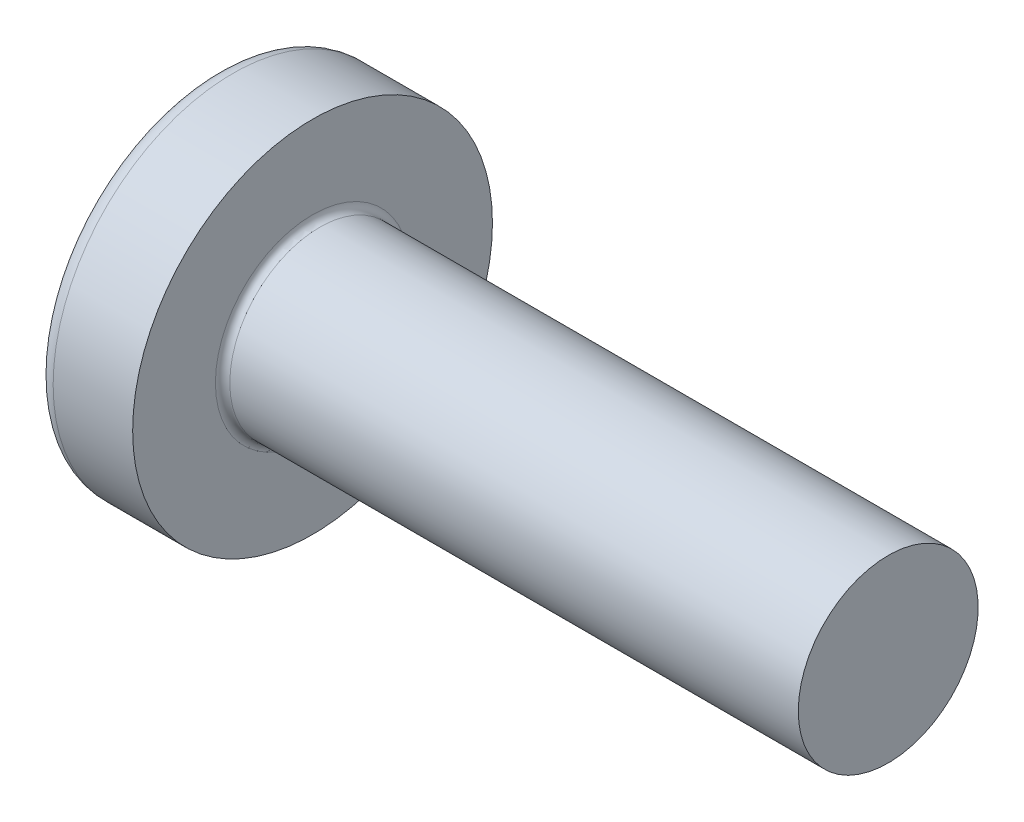
ISO-10303-21;
HEADER;
FILE_DESCRIPTION(('STEP AP214'),'2;1');
FILE_NAME('part.step','',(''),(''),'','','');
FILE_SCHEMA(('AUTOMOTIVE_DESIGN { 1 0 10303 214 1 1 1 1 }'));
ENDSEC;
DATA;
#1=APPLICATION_CONTEXT('core data for automotive mechanical design processes');
#2=APPLICATION_PROTOCOL_DEFINITION('international standard','automotive_design',2000,#1);
#3=PRODUCT_CONTEXT('',#1,'mechanical');
#4=PRODUCT('Part','Part','',(#3));
#5=PRODUCT_RELATED_PRODUCT_CATEGORY('part','',(#4));
#6=PRODUCT_DEFINITION_FORMATION('','',#4);
#7=PRODUCT_DEFINITION_CONTEXT('part definition',#1,'design');
#8=PRODUCT_DEFINITION('design','',#6,#7);
#9=PRODUCT_DEFINITION_SHAPE('','',#8);
#10=(LENGTH_UNIT() NAMED_UNIT(*) SI_UNIT(.MILLI.,.METRE.));
#11=(NAMED_UNIT(*) PLANE_ANGLE_UNIT() SI_UNIT($,.RADIAN.));
#12=(NAMED_UNIT(*) SI_UNIT($,.STERADIAN.) SOLID_ANGLE_UNIT());
#13=UNCERTAINTY_MEASURE_WITH_UNIT(LENGTH_MEASURE(1.E-05),#10,'distance_accuracy_value','');
#14=(GEOMETRIC_REPRESENTATION_CONTEXT(3) GLOBAL_UNCERTAINTY_ASSIGNED_CONTEXT((#13)) GLOBAL_UNIT_ASSIGNED_CONTEXT((#10,
#11,#12)) REPRESENTATION_CONTEXT('',''));
#15=CARTESIAN_POINT('',(0.,0.,0.));
#16=DIRECTION('',(0.,0.,1.));
#17=DIRECTION('',(1.,0.,0.));
#18=AXIS2_PLACEMENT_3D('',#15,#16,#17);
#19=CARTESIAN_POINT('',(4.,0.,0.));
#20=DIRECTION('',(-1.,0.,0.));
#21=DIRECTION('',(0.,1.,0.));
#22=AXIS2_PLACEMENT_3D('',#19,#20,#21);
#23=SPHERICAL_SURFACE('',#22,4.);
#24=CARTESIAN_POINT('',(0.803195914613468,0.,0.));
#25=DIRECTION('',(-1.,0.,0.));
#26=DIRECTION('',(0.,0.,1.));
#27=AXIS2_PLACEMENT_3D('',#24,#25,#26);
#28=CIRCLE('',#27,2.40425531914894);
#29=CARTESIAN_POINT('',(0.803195914613468,0.,2.40425531914894));
#30=VERTEX_POINT('',#29);
#31=EDGE_CURVE('E238',#30,#30,#28,.T.);
#32=ORIENTED_EDGE('',*,*,#31,.T.);
#33=EDGE_LOOP('',(#32));
#34=FACE_BOUND('',#33,.T.);
#35=CARTESIAN_POINT('',(0.0543400780062932,0.,0.));
#36=DIRECTION('',(1.,0.,0.));
#37=DIRECTION('',(0.,0.,-1.));
#38=AXIS2_PLACEMENT_3D('',#35,#36,#37);
#39=CIRCLE('',#38,0.657090389499513);
#40=CARTESIAN_POINT('',(0.0543400780062951,-0.369999999999997,-0.543017292517121));
#41=VERTEX_POINT('',#40);
#42=CARTESIAN_POINT('',(0.0543400780062936,-0.543017292517123,-0.37));
#43=VERTEX_POINT('',#42);
#44=EDGE_CURVE('E374',#41,#43,#39,.F.);
#45=ORIENTED_EDGE('',*,*,#44,.F.);
#46=CARTESIAN_POINT('',(4.,-0.370000000000001,0.));
#47=DIRECTION('',(0.,1.,0.));
#48=DIRECTION('',(0.,0.,1.));
#49=AXIS2_PLACEMENT_3D('',#46,#47,#48);
#50=CIRCLE('',#49,3.98285073785097);
#51=CARTESIAN_POINT('',(0.201999111211585,-0.369999999999995,-1.19928697514916));
#52=VERTEX_POINT('',#51);
#53=EDGE_CURVE('E300',#52,#41,#50,.T.);
#54=ORIENTED_EDGE('',*,*,#53,.F.);
#55=CARTESIAN_POINT('',(3.72274328891674,0.,0.556091024961349));
#56=DIRECTION('',(0.446197753347436,0.,-0.894934391398443));
#57=DIRECTION('',(-0.894934391398443,0.,-0.446197753347436));
#58=AXIS2_PLACEMENT_3D('',#55,#56,#57);
#59=CIRCLE('',#58,3.95144169742092);
#60=CARTESIAN_POINT('',(0.201999111211586,0.370000000000004,-1.19928697514915));
#61=VERTEX_POINT('',#60);
#62=EDGE_CURVE('E272',#52,#61,#59,.T.);
#63=ORIENTED_EDGE('',*,*,#62,.T.);
#64=CARTESIAN_POINT('',(4.,0.369999999999999,0.));
#65=DIRECTION('',(0.,-1.,0.));
#66=DIRECTION('',(0.,0.,-1.));
#67=AXIS2_PLACEMENT_3D('',#64,#65,#66);
#68=CIRCLE('',#67,3.98285073785097);
#69=CARTESIAN_POINT('',(0.0543400780062952,0.370000000000002,-0.543017292517117));
#70=VERTEX_POINT('',#69);
#71=EDGE_CURVE('E327',#70,#61,#68,.T.);
#72=ORIENTED_EDGE('',*,*,#71,.F.);
#73=CARTESIAN_POINT('',(0.0543400780062936,0.543017292517112,-0.37));
#74=VERTEX_POINT('',#73);
#75=EDGE_CURVE('E393',#74,#70,#39,.F.);
#76=ORIENTED_EDGE('',*,*,#75,.F.);
#77=CARTESIAN_POINT('',(4.,0.,-0.369999999999999));
#78=DIRECTION('',(0.,0.,1.));
#79=DIRECTION('',(1.,0.,0.));
#80=AXIS2_PLACEMENT_3D('',#77,#78,#79);
#81=CIRCLE('',#80,3.98285073785097);
#82=CARTESIAN_POINT('',(0.201999111211586,1.19928697514915,-0.37));
#83=VERTEX_POINT('',#82);
#84=EDGE_CURVE('E266',#83,#74,#81,.T.);
#85=ORIENTED_EDGE('',*,*,#84,.F.);
#86=CARTESIAN_POINT('',(3.72274328891675,-0.55609102496135,0.));
#87=DIRECTION('',(0.446197753347436,0.894934391398443,0.));
#88=DIRECTION('',(-0.894934391398443,0.446197753347436,0.));
#89=AXIS2_PLACEMENT_3D('',#86,#87,#88);
#90=CIRCLE('',#89,3.95144169742092);
#91=CARTESIAN_POINT('',(0.201999111211587,1.19928697514915,0.37));
#92=VERTEX_POINT('',#91);
#93=EDGE_CURVE('E269',#83,#92,#90,.T.);
#94=ORIENTED_EDGE('',*,*,#93,.T.);
#95=CARTESIAN_POINT('',(4.,0.,0.370000000000001));
#96=DIRECTION('',(0.,0.,-1.));
#97=DIRECTION('',(-1.,0.,0.));
#98=AXIS2_PLACEMENT_3D('',#95,#96,#97);
#99=CIRCLE('',#98,3.98285073785097);
#100=CARTESIAN_POINT('',(0.0543400780062932,0.543017292517108,0.369999999999999));
#101=VERTEX_POINT('',#100);
#102=EDGE_CURVE('E262',#101,#92,#99,.T.);
#103=ORIENTED_EDGE('',*,*,#102,.F.);
#104=CARTESIAN_POINT('',(0.0543400780062959,0.369999999999998,0.54301729251712));
#105=VERTEX_POINT('',#104);
#106=EDGE_CURVE('E427',#105,#101,#39,.F.);
#107=ORIENTED_EDGE('',*,*,#106,.F.);
#108=CARTESIAN_POINT('',(0.201999111211586,0.369999999999996,1.19928697514915));
#109=VERTEX_POINT('',#108);
#110=EDGE_CURVE('E282',#109,#105,#68,.T.);
#111=ORIENTED_EDGE('',*,*,#110,.F.);
#112=CARTESIAN_POINT('',(3.72274328891674,0.,-0.556091024961349));
#113=DIRECTION('',(0.446197753347436,0.,0.894934391398443));
#114=DIRECTION('',(0.894934391398443,0.,-0.446197753347436));
#115=AXIS2_PLACEMENT_3D('',#112,#113,#114);
#116=CIRCLE('',#115,3.95144169742092);
#117=CARTESIAN_POINT('',(0.201999111211585,-0.370000000000004,1.19928697514915));
#118=VERTEX_POINT('',#117);
#119=EDGE_CURVE('E49',#109,#118,#116,.T.);
#120=ORIENTED_EDGE('',*,*,#119,.T.);
#121=CARTESIAN_POINT('',(0.0543400780062944,-0.370000000000001,0.543017292517118));
#122=VERTEX_POINT('',#121);
#123=EDGE_CURVE('E279',#122,#118,#50,.T.);
#124=ORIENTED_EDGE('',*,*,#123,.F.);
#125=CARTESIAN_POINT('',(0.0543400780062932,-0.543017292517118,0.369999999999999));
#126=VERTEX_POINT('',#125);
#127=EDGE_CURVE('E392',#126,#122,#39,.F.);
#128=ORIENTED_EDGE('',*,*,#127,.F.);
#129=CARTESIAN_POINT('',(0.201999111211583,-1.19928697514916,0.369999999999999));
#130=VERTEX_POINT('',#129);
#131=EDGE_CURVE('E263',#130,#126,#99,.T.);
#132=ORIENTED_EDGE('',*,*,#131,.F.);
#133=CARTESIAN_POINT('',(3.72274328891674,0.556091024961348,0.));
#134=DIRECTION('',(0.446197753347436,-0.894934391398443,0.));
#135=DIRECTION('',(0.894934391398443,0.446197753347436,0.));
#136=AXIS2_PLACEMENT_3D('',#133,#134,#135);
#137=CIRCLE('',#136,3.95144169742092);
#138=CARTESIAN_POINT('',(0.201999111211583,-1.19928697514915,-0.37));
#139=VERTEX_POINT('',#138);
#140=EDGE_CURVE('E259',#130,#139,#137,.T.);
#141=ORIENTED_EDGE('',*,*,#140,.T.);
#142=EDGE_CURVE('E64',#43,#139,#81,.T.);
#143=ORIENTED_EDGE('',*,*,#142,.F.);
#144=EDGE_LOOP('',(#45,#54,#63,#72,#76,#85,#94,#103,#107,#111,#120,#124,#128,#132,#141,#143));
#145=FACE_BOUND('',#144,.T.);
#146=ADVANCED_FACE('F36',(#34,#145),#23,.T.);
#147=CARTESIAN_POINT('',(1.5,0.552127712987655,-0.37));
#148=DIRECTION('',(0.,0.,1.));
#149=DIRECTION('',(1.,0.,0.));
#150=AXIS2_PLACEMENT_3D('',#147,#148,#149);
#151=PLANE('',#150);
#152=ORIENTED_EDGE('',*,*,#84,.T.);
#153=CARTESIAN_POINT('',(-0.984107487670367,0.628943903400079,-0.37));
#154=CARTESIAN_POINT('',(-0.783603343010497,0.61266994729586,-0.37));
#155=CARTESIAN_POINT('',(-0.583110931105435,0.596248129681252,-0.37));
#156=CARTESIAN_POINT('',(-0.182155788453109,0.562989164841799,-0.37));
#157=CARTESIAN_POINT('',(0.0183069414727268,0.546152007726099,-0.37));
#158=CARTESIAN_POINT('',(0.419186928470242,0.511943523152269,-0.37));
#159=CARTESIAN_POINT('',(0.619604185545593,0.494572195737286,-0.37));
#160=CARTESIAN_POINT('',(1.02037173794803,0.459102589125813,-0.37));
#161=CARTESIAN_POINT('',(1.2207220342401,0.441004320904832,-0.37));
#162=CARTESIAN_POINT('',(1.53631168775438,0.411665443099097,-0.37));
#163=CARTESIAN_POINT('',(1.65158348734389,0.400774467003668,-0.37));
#164=CARTESIAN_POINT('',(1.88208360561995,0.378547148307843,-0.37));
#165=CARTESIAN_POINT('',(1.99731192453001,0.367210808029148,-0.37));
#166=CARTESIAN_POINT('',(2.22771614129417,0.343963614894539,-0.37));
#167=CARTESIAN_POINT('',(2.34289203669258,0.332052737461205,-0.37));
#168=CARTESIAN_POINT('',(2.57315819348689,0.307413208767175,-0.37));
#169=CARTESIAN_POINT('',(2.68824845325201,0.294684542317003,-0.37));
#170=CARTESIAN_POINT('',(2.80327961663977,0.281425340988347,-0.37));
#171=B_SPLINE_CURVE_WITH_KNOTS('',3,(#153,#154,#155,#156,#157,#158,#159,#160,#161,#162,#163,
#164,#165,#166,#167,#168,#169,#170),.UNSPECIFIED.,.F.,.F.,(4,2,2,2,2,2,2,2,4),(0.,
0.603490856265592,1.20699609790448,1.81050129079485,2.41399737525605,2.76135214324501,
3.1087051006998,3.45607293034176,3.80344721380205),.UNSPECIFIED.);
#172=CARTESIAN_POINT('',(1.5,0.415013252800437,-0.370000000000001));
#173=VERTEX_POINT('',#172);
#174=EDGE_CURVE('E414',#74,#173,#171,.T.);
#175=ORIENTED_EDGE('',*,*,#174,.T.);
#176=DIRECTION('',(0.,1.,0.));
#177=VECTOR('',#176,1.);
#178=CARTESIAN_POINT('',(1.5,-0.552127712987656,-0.37));
#179=LINE('',#178,#177);
#180=CARTESIAN_POINT('',(1.5,0.552127712987655,-0.37));
#181=VERTEX_POINT('',#180);
#182=EDGE_CURVE('E356',#173,#181,#179,.T.);
#183=ORIENTED_EDGE('',*,*,#182,.T.);
#184=DIRECTION('',(0.894934391398442,-0.446197753347436,0.));
#185=VECTOR('',#184,1.);
#186=CARTESIAN_POINT('',(0.,1.3,-0.37));
#187=LINE('',#186,#185);
#188=EDGE_CURVE('E239',#83,#181,#187,.T.);
#189=ORIENTED_EDGE('',*,*,#188,.F.);
#190=EDGE_LOOP('',(#152,#175,#183,#189));
#191=FACE_BOUND('',#190,.T.);
#192=ADVANCED_FACE('F194',(#191),#151,.T.);
#193=CARTESIAN_POINT('',(1.5,-0.552127712987656,-0.37));
#194=VERTEX_POINT('',#193);
#195=CARTESIAN_POINT('',(1.5,-0.415013252800437,-0.370000000000001));
#196=VERTEX_POINT('',#195);
#197=EDGE_CURVE('E247',#194,#196,#179,.T.);
#198=ORIENTED_EDGE('',*,*,#197,.T.);
#199=CARTESIAN_POINT('',(-0.984107487670368,-0.628943903400079,-0.37));
#200=CARTESIAN_POINT('',(-0.783603343010499,-0.61266994729586,-0.37));
#201=CARTESIAN_POINT('',(-0.583110931105436,-0.596248129681252,-0.37));
#202=CARTESIAN_POINT('',(-0.18215578845311,-0.562989164841799,-0.37));
#203=CARTESIAN_POINT('',(0.0183069414727261,-0.546152007726099,-0.37));
#204=CARTESIAN_POINT('',(0.419186928470242,-0.511943523152269,-0.37));
#205=CARTESIAN_POINT('',(0.619604185545593,-0.494572195737286,-0.37));
#206=CARTESIAN_POINT('',(1.02037173794803,-0.459102589125813,-0.37));
#207=CARTESIAN_POINT('',(1.22072203424009,-0.441004320904832,-0.37));
#208=CARTESIAN_POINT('',(1.53631168775438,-0.411665443099097,-0.37));
#209=CARTESIAN_POINT('',(1.65158348734389,-0.400774467003668,-0.37));
#210=CARTESIAN_POINT('',(1.88208360561995,-0.378547148307843,-0.37));
#211=CARTESIAN_POINT('',(1.99731192453001,-0.367210808029148,-0.37));
#212=CARTESIAN_POINT('',(2.22771614129417,-0.343963614894539,-0.37));
#213=CARTESIAN_POINT('',(2.34289203669258,-0.332052737461204,-0.37));
#214=CARTESIAN_POINT('',(2.57315819348689,-0.307413208767175,-0.37));
#215=CARTESIAN_POINT('',(2.68824845325202,-0.294684542317003,-0.37));
#216=CARTESIAN_POINT('',(2.80327961663977,-0.281425340988347,-0.37));
#217=B_SPLINE_CURVE_WITH_KNOTS('',3,(#199,#200,#201,#202,#203,#204,#205,#206,#207,#208,#209,
#210,#211,#212,#213,#214,#215,#216),.UNSPECIFIED.,.F.,.F.,(4,2,2,2,2,2,2,2,4),(0.,
0.603490856265592,1.20699609790448,1.81050129079485,2.41399737525605,2.76135214324501,
3.1087051006998,3.45607293034176,3.80344721380205),.UNSPECIFIED.);
#218=EDGE_CURVE('E391',#196,#43,#217,.F.);
#219=ORIENTED_EDGE('',*,*,#218,.T.);
#220=ORIENTED_EDGE('',*,*,#142,.T.);
#221=DIRECTION('',(0.894934391398442,0.446197753347436,0.));
#222=VECTOR('',#221,1.);
#223=CARTESIAN_POINT('',(0.,-1.3,-0.37));
#224=LINE('',#223,#222);
#225=EDGE_CURVE('E330',#139,#194,#224,.T.);
#226=ORIENTED_EDGE('',*,*,#225,.T.);
#227=EDGE_LOOP('',(#198,#219,#220,#226));
#228=FACE_BOUND('',#227,.T.);
#229=ADVANCED_FACE('F200',(#228),#151,.T.);
#230=CARTESIAN_POINT('',(1.5,-0.552127712987656,0.37));
#231=DIRECTION('',(0.,0.,-1.));
#232=DIRECTION('',(-1.,0.,0.));
#233=AXIS2_PLACEMENT_3D('',#230,#231,#232);
#234=PLANE('',#233);
#235=DIRECTION('',(0.,-1.,0.));
#236=VECTOR('',#235,1.);
#237=CARTESIAN_POINT('',(1.5,0.552127712987656,0.37));
#238=LINE('',#237,#236);
#239=CARTESIAN_POINT('',(1.5,0.552127712987656,0.37));
#240=VERTEX_POINT('',#239);
#241=CARTESIAN_POINT('',(1.5,0.415013252800437,0.370000000000001));
#242=VERTEX_POINT('',#241);
#243=EDGE_CURVE('E339',#240,#242,#238,.T.);
#244=ORIENTED_EDGE('',*,*,#243,.T.);
#245=CARTESIAN_POINT('',(-0.984107487668668,0.628943903399942,0.369999999999999));
#246=CARTESIAN_POINT('',(-0.783603343008973,0.612669947295736,0.369999999999999));
#247=CARTESIAN_POINT('',(-0.583110931104085,0.596248129681141,0.369999999999999));
#248=CARTESIAN_POINT('',(-0.182155788452108,0.562989164841716,0.369999999999999));
#249=CARTESIAN_POINT('',(0.018306941473554,0.54615200772603,0.369999999999999));
#250=CARTESIAN_POINT('',(0.419186928470488,0.511943523152248,0.369999999999999));
#251=CARTESIAN_POINT('',(0.619604185545431,0.4945721957373,0.369999999999999));
#252=CARTESIAN_POINT('',(1.02037173794706,0.459102589125901,0.37));
#253=CARTESIAN_POINT('',(1.22072203423871,0.441004320904958,0.37));
#254=CARTESIAN_POINT('',(1.53631168775259,0.411665443099266,0.37));
#255=CARTESIAN_POINT('',(1.65158348734209,0.400774467003839,0.37));
#256=CARTESIAN_POINT('',(1.88208360561816,0.378547148308018,0.37));
#257=CARTESIAN_POINT('',(1.99731192452822,0.367210808029325,0.37));
#258=CARTESIAN_POINT('',(2.22771614129237,0.343963614894723,0.37));
#259=CARTESIAN_POINT('',(2.34289203669079,0.332052737461391,0.37));
#260=CARTESIAN_POINT('',(2.5731581934851,0.30741320876737,0.370000000000001));
#261=CARTESIAN_POINT('',(2.68824845325022,0.294684542317203,0.370000000000001));
#262=CARTESIAN_POINT('',(2.80327961663798,0.281425340988553,0.370000000000001));
#263=B_SPLINE_CURVE_WITH_KNOTS('',3,(#245,#246,#247,#248,#249,#250,#251,#252,#253,#254,#255,
#256,#257,#258,#259,#260,#261,#262),.UNSPECIFIED.,.F.,.F.,(4,2,2,2,2,2,2,2,4),(0.,
0.603490856265067,1.20699609790343,1.81050129079257,2.41399737525255,2.7613521432415,
3.1087051006963,3.45607293033825,3.80344721379854),.UNSPECIFIED.);
#264=EDGE_CURVE('E428',#242,#101,#263,.F.);
#265=ORIENTED_EDGE('',*,*,#264,.T.);
#266=ORIENTED_EDGE('',*,*,#102,.T.);
#267=DIRECTION('',(0.894934391398443,-0.446197753347436,0.));
#268=VECTOR('',#267,1.);
#269=CARTESIAN_POINT('',(0.,1.3,0.37));
#270=LINE('',#269,#268);
#271=EDGE_CURVE('E244',#92,#240,#270,.T.);
#272=ORIENTED_EDGE('',*,*,#271,.T.);
#273=EDGE_LOOP('',(#244,#265,#266,#272));
#274=FACE_BOUND('',#273,.T.);
#275=ADVANCED_FACE('F410',(#274),#234,.T.);
#276=ORIENTED_EDGE('',*,*,#131,.T.);
#277=CARTESIAN_POINT('',(-0.984107487670366,-0.62894390340008,0.369999999999999));
#278=CARTESIAN_POINT('',(-0.783603343010497,-0.612669947295861,0.369999999999999));
#279=CARTESIAN_POINT('',(-0.583110931105434,-0.596248129681253,0.369999999999999));
#280=CARTESIAN_POINT('',(-0.182155788453108,-0.5629891648418,0.369999999999999));
#281=CARTESIAN_POINT('',(0.0183069414727277,-0.5461520077261,0.369999999999999));
#282=CARTESIAN_POINT('',(0.419186928470243,-0.511943523152269,0.369999999999999));
#283=CARTESIAN_POINT('',(0.619604185545594,-0.494572195737286,0.369999999999999));
#284=CARTESIAN_POINT('',(1.02037173794804,-0.459102589125813,0.37));
#285=CARTESIAN_POINT('',(1.2207220342401,-0.441004320904833,0.37));
#286=CARTESIAN_POINT('',(1.53631168775438,-0.411665443099097,0.37));
#287=CARTESIAN_POINT('',(1.65158348734389,-0.400774467003668,0.37));
#288=CARTESIAN_POINT('',(1.88208360561995,-0.378547148307843,0.37));
#289=CARTESIAN_POINT('',(1.99731192453001,-0.367210808029148,0.37));
#290=CARTESIAN_POINT('',(2.22771614129417,-0.343963614894539,0.37));
#291=CARTESIAN_POINT('',(2.34289203669258,-0.332052737461204,0.37));
#292=CARTESIAN_POINT('',(2.57315819348689,-0.307413208767174,0.37));
#293=CARTESIAN_POINT('',(2.68824845325201,-0.294684542317002,0.370000000000001));
#294=CARTESIAN_POINT('',(2.80327961663977,-0.281425340988346,0.370000000000001));
#295=B_SPLINE_CURVE_WITH_KNOTS('',3,(#277,#278,#279,#280,#281,#282,#283,#284,#285,#286,#287,
#288,#289,#290,#291,#292,#293,#294),.UNSPECIFIED.,.F.,.F.,(4,2,2,2,2,2,2,2,4),(0.,
0.603490856265592,1.20699609790448,1.81050129079485,2.41399737525605,2.76135214324501,
3.1087051006998,3.45607293034176,3.80344721380205),.UNSPECIFIED.);
#296=CARTESIAN_POINT('',(1.5,-0.415013252800437,0.370000000000001));
#297=VERTEX_POINT('',#296);
#298=EDGE_CURVE('E447',#126,#297,#295,.T.);
#299=ORIENTED_EDGE('',*,*,#298,.T.);
#300=CARTESIAN_POINT('',(1.5,-0.552127712987656,0.37));
#301=VERTEX_POINT('',#300);
#302=EDGE_CURVE('E341',#297,#301,#238,.T.);
#303=ORIENTED_EDGE('',*,*,#302,.T.);
#304=DIRECTION('',(0.894934391398442,0.446197753347436,0.));
#305=VECTOR('',#304,1.);
#306=CARTESIAN_POINT('',(0.,-1.3,0.369999999999999));
#307=LINE('',#306,#305);
#308=EDGE_CURVE('E332',#130,#301,#307,.T.);
#309=ORIENTED_EDGE('',*,*,#308,.F.);
#310=EDGE_LOOP('',(#276,#299,#303,#309));
#311=FACE_BOUND('',#310,.T.);
#312=ADVANCED_FACE('F508',(#311),#234,.T.);
#313=CARTESIAN_POINT('',(1.5,0.552127712987656,0.37));
#314=DIRECTION('',(0.446197753347436,0.894934391398443,0.));
#315=DIRECTION('',(-0.894934391398443,0.446197753347436,0.));
#316=AXIS2_PLACEMENT_3D('',#313,#314,#315);
#317=PLANE('',#316);
#318=CARTESIAN_POINT('',(2.47007552564217,0.068465978363179,0.));
#319=DIRECTION('',(0.446197753347436,0.894934391398443,0.));
#320=DIRECTION('',(-0.894934391398443,0.446197753347436,0.));
#321=AXIS2_PLACEMENT_3D('',#318,#319,#320);
#322=ELLIPSE('',#321,1.0940568559235,0.483340636970288);
#323=CARTESIAN_POINT('',(1.5,0.552127712987657,0.065505637551436));
#324=VERTEX_POINT('',#323);
#325=CARTESIAN_POINT('',(1.5,0.552127712987657,-0.0655056375514364));
#326=VERTEX_POINT('',#325);
#327=EDGE_CURVE('E305',#324,#326,#322,.F.);
#328=ORIENTED_EDGE('',*,*,#327,.F.);
#329=DIRECTION('',(0.,0.,-1.));
#330=VECTOR('',#329,1.);
#331=CARTESIAN_POINT('',(1.5,0.552127712987656,0.37));
#332=LINE('',#331,#330);
#333=EDGE_CURVE('E342',#240,#324,#332,.T.);
#334=ORIENTED_EDGE('',*,*,#333,.F.);
#335=ORIENTED_EDGE('',*,*,#271,.F.);
#336=ORIENTED_EDGE('',*,*,#93,.F.);
#337=ORIENTED_EDGE('',*,*,#188,.T.);
#338=EDGE_CURVE('E344',#326,#181,#332,.T.);
#339=ORIENTED_EDGE('',*,*,#338,.F.);
#340=EDGE_LOOP('',(#328,#334,#335,#336,#337,#339));
#341=FACE_BOUND('',#340,.T.);
#342=ADVANCED_FACE('F408',(#341),#317,.F.);
#343=CARTESIAN_POINT('',(1.5,-0.552127712987656,-0.37));
#344=DIRECTION('',(0.446197753347436,-0.894934391398443,0.));
#345=DIRECTION('',(0.894934391398443,0.446197753347436,0.));
#346=AXIS2_PLACEMENT_3D('',#343,#344,#345);
#347=PLANE('',#346);
#348=CARTESIAN_POINT('',(2.47007552564217,-0.0684659783631787,0.));
#349=DIRECTION('',(0.446197753347436,-0.894934391398443,0.));
#350=DIRECTION('',(-0.894934391398443,-0.446197753347436,0.));
#351=AXIS2_PLACEMENT_3D('',#348,#349,#350);
#352=ELLIPSE('',#351,1.0940568559235,0.483340636970288);
#353=CARTESIAN_POINT('',(1.5,-0.552127712987657,-0.0655056375514334));
#354=VERTEX_POINT('',#353);
#355=CARTESIAN_POINT('',(1.5,-0.552127712987657,0.0655056375514334));
#356=VERTEX_POINT('',#355);
#357=EDGE_CURVE('E452',#354,#356,#352,.F.);
#358=ORIENTED_EDGE('',*,*,#357,.F.);
#359=DIRECTION('',(0.,0.,1.));
#360=VECTOR('',#359,1.);
#361=CARTESIAN_POINT('',(1.5,-0.552127712987656,-0.37));
#362=LINE('',#361,#360);
#363=EDGE_CURVE('E335',#194,#354,#362,.T.);
#364=ORIENTED_EDGE('',*,*,#363,.F.);
#365=ORIENTED_EDGE('',*,*,#225,.F.);
#366=ORIENTED_EDGE('',*,*,#140,.F.);
#367=ORIENTED_EDGE('',*,*,#308,.T.);
#368=EDGE_CURVE('E338',#356,#301,#362,.T.);
#369=ORIENTED_EDGE('',*,*,#368,.F.);
#370=EDGE_LOOP('',(#358,#364,#365,#366,#367,#369));
#371=FACE_BOUND('',#370,.T.);
#372=ADVANCED_FACE('F500',(#371),#347,.F.);
#373=CARTESIAN_POINT('',(1.5,-0.552127712987656,-0.37));
#374=DIRECTION('',(1.,0.,0.));
#375=DIRECTION('',(0.,0.,-1.));
#376=AXIS2_PLACEMENT_3D('',#373,#374,#375);
#377=PLANE('',#376);
#378=CARTESIAN_POINT('',(1.5,0.,0.));
#379=DIRECTION('',(-1.,0.,0.));
#380=DIRECTION('',(0.,0.,1.));
#381=AXIS2_PLACEMENT_3D('',#378,#379,#380);
#382=CIRCLE('',#381,0.556);
#383=CARTESIAN_POINT('',(1.5,-0.065505637551439,-0.552127712987656));
#384=VERTEX_POINT('',#383);
#385=CARTESIAN_POINT('',(1.5,-0.369999999999998,-0.415013252800438));
#386=VERTEX_POINT('',#385);
#387=EDGE_CURVE('E56',#384,#386,#382,.T.);
#388=ORIENTED_EDGE('',*,*,#387,.F.);
#389=DIRECTION('',(0.,-1.,0.));
#390=VECTOR('',#389,1.);
#391=CARTESIAN_POINT('',(1.5,0.370000000000002,-0.552127712987655));
#392=LINE('',#391,#390);
#393=CARTESIAN_POINT('',(1.5,-0.369999999999998,-0.552127712987657));
#394=VERTEX_POINT('',#393);
#395=EDGE_CURVE('E315',#384,#394,#392,.T.);
#396=ORIENTED_EDGE('',*,*,#395,.T.);
#397=DIRECTION('',(0.,0.,-1.));
#398=VECTOR('',#397,1.);
#399=CARTESIAN_POINT('',(1.5,-0.370000000000002,0.552127712987654));
#400=LINE('',#399,#398);
#401=EDGE_CURVE('E319',#386,#394,#400,.T.);
#402=ORIENTED_EDGE('',*,*,#401,.F.);
#403=EDGE_LOOP('',(#388,#396,#402));
#404=FACE_BOUND('',#403,.T.);
#405=ADVANCED_FACE('F380',(#404),#377,.F.);
#406=EDGE_CURVE('E385',#196,#354,#382,.T.);
#407=ORIENTED_EDGE('',*,*,#406,.F.);
#408=ORIENTED_EDGE('',*,*,#197,.F.);
#409=ORIENTED_EDGE('',*,*,#363,.T.);
#410=EDGE_LOOP('',(#407,#408,#409));
#411=FACE_BOUND('',#410,.T.);
#412=ADVANCED_FACE('F507',(#411),#377,.F.);
#413=EDGE_CURVE('E515',#356,#297,#382,.T.);
#414=ORIENTED_EDGE('',*,*,#413,.F.);
#415=ORIENTED_EDGE('',*,*,#368,.T.);
#416=ORIENTED_EDGE('',*,*,#302,.F.);
#417=EDGE_LOOP('',(#414,#415,#416));
#418=FACE_BOUND('',#417,.T.);
#419=ADVANCED_FACE('F496',(#418),#377,.F.);
#420=CARTESIAN_POINT('',(1.5,-0.370000000000001,0.415013252800436));
#421=VERTEX_POINT('',#420);
#422=CARTESIAN_POINT('',(1.5,-0.0655056375514443,0.552127712987656));
#423=VERTEX_POINT('',#422);
#424=EDGE_CURVE('E483',#421,#423,#382,.T.);
#425=ORIENTED_EDGE('',*,*,#424,.F.);
#426=CARTESIAN_POINT('',(1.5,-0.370000000000002,0.552127712987654));
#427=VERTEX_POINT('',#426);
#428=EDGE_CURVE('E316',#427,#421,#400,.T.);
#429=ORIENTED_EDGE('',*,*,#428,.F.);
#430=DIRECTION('',(0.,1.,0.));
#431=VECTOR('',#430,1.);
#432=CARTESIAN_POINT('',(1.5,-0.370000000000002,0.552127712987654));
#433=LINE('',#432,#431);
#434=EDGE_CURVE('E320',#427,#423,#433,.T.);
#435=ORIENTED_EDGE('',*,*,#434,.T.);
#436=EDGE_LOOP('',(#425,#429,#435));
#437=FACE_BOUND('',#436,.T.);
#438=ADVANCED_FACE('F481',(#437),#377,.F.);
#439=CARTESIAN_POINT('',(1.5,0.0655056375514408,0.552127712987656));
#440=VERTEX_POINT('',#439);
#441=CARTESIAN_POINT('',(1.5,0.369999999999998,0.415013252800439));
#442=VERTEX_POINT('',#441);
#443=EDGE_CURVE('E386',#440,#442,#382,.T.);
#444=ORIENTED_EDGE('',*,*,#443,.F.);
#445=CARTESIAN_POINT('',(1.5,0.369999999999998,0.552127712987657));
#446=VERTEX_POINT('',#445);
#447=EDGE_CURVE('E323',#440,#446,#433,.T.);
#448=ORIENTED_EDGE('',*,*,#447,.T.);
#449=DIRECTION('',(0.,0.,1.));
#450=VECTOR('',#449,1.);
#451=CARTESIAN_POINT('',(1.5,0.370000000000002,-0.552127712987655));
#452=LINE('',#451,#450);
#453=EDGE_CURVE('E297',#442,#446,#452,.T.);
#454=ORIENTED_EDGE('',*,*,#453,.F.);
#455=EDGE_LOOP('',(#444,#448,#454));
#456=FACE_BOUND('',#455,.T.);
#457=ADVANCED_FACE('F489',(#456),#377,.F.);
#458=EDGE_CURVE('E466',#242,#324,#382,.T.);
#459=ORIENTED_EDGE('',*,*,#458,.F.);
#460=ORIENTED_EDGE('',*,*,#243,.F.);
#461=ORIENTED_EDGE('',*,*,#333,.T.);
#462=EDGE_LOOP('',(#459,#460,#461));
#463=FACE_BOUND('',#462,.T.);
#464=ADVANCED_FACE('F491',(#463),#377,.F.);
#465=EDGE_CURVE('E464',#326,#173,#382,.T.);
#466=ORIENTED_EDGE('',*,*,#465,.F.);
#467=ORIENTED_EDGE('',*,*,#338,.T.);
#468=ORIENTED_EDGE('',*,*,#182,.F.);
#469=EDGE_LOOP('',(#466,#467,#468));
#470=FACE_BOUND('',#469,.T.);
#471=ADVANCED_FACE('F438',(#470),#377,.F.);
#472=CARTESIAN_POINT('',(1.5,-0.369999999999998,-0.552127712987657));
#473=DIRECTION('',(0.,1.,0.));
#474=DIRECTION('',(-1.,0.,0.));
#475=AXIS2_PLACEMENT_3D('',#472,#473,#474);
#476=PLANE('',#475);
#477=ORIENTED_EDGE('',*,*,#428,.T.);
#478=CARTESIAN_POINT('',(-0.984107487668669,-0.370000000000001,0.628943903399941));
#479=CARTESIAN_POINT('',(-0.783603343008973,-0.370000000000001,0.612669947295735));
#480=CARTESIAN_POINT('',(-0.583110931104085,-0.370000000000001,0.59624812968114));
#481=CARTESIAN_POINT('',(-0.182155788452108,-0.370000000000001,0.562989164841714));
#482=CARTESIAN_POINT('',(0.0183069414735538,-0.370000000000001,0.546152007726028));
#483=CARTESIAN_POINT('',(0.419186928470487,-0.370000000000001,0.511943523152246));
#484=CARTESIAN_POINT('',(0.619604185545431,-0.370000000000001,0.494572195737299));
#485=CARTESIAN_POINT('',(1.02037173794706,-0.370000000000001,0.459102589125899));
#486=CARTESIAN_POINT('',(1.22072203423871,-0.370000000000001,0.441004320904957));
#487=CARTESIAN_POINT('',(1.53631168775259,-0.370000000000001,0.411665443099264));
#488=CARTESIAN_POINT('',(1.65158348734209,-0.370000000000001,0.400774467003838));
#489=CARTESIAN_POINT('',(1.88208360561815,-0.370000000000001,0.378547148308017));
#490=CARTESIAN_POINT('',(1.99731192452822,-0.370000000000001,0.367210808029324));
#491=CARTESIAN_POINT('',(2.22771614129237,-0.370000000000001,0.343963614894721));
#492=CARTESIAN_POINT('',(2.34289203669079,-0.370000000000002,0.33205273746139));
#493=CARTESIAN_POINT('',(2.5731581934851,-0.370000000000002,0.307413208767369));
#494=CARTESIAN_POINT('',(2.68824845325022,-0.370000000000002,0.294684542317202));
#495=CARTESIAN_POINT('',(2.80327961663798,-0.370000000000002,0.281425340988552));
#496=B_SPLINE_CURVE_WITH_KNOTS('',3,(#478,#479,#480,#481,#482,#483,#484,#485,#486,#487,#488,
#489,#490,#491,#492,#493,#494,#495),.UNSPECIFIED.,.F.,.F.,(4,2,2,2,2,2,2,2,4),(0.,
0.603490856265068,1.20699609790343,1.81050129079257,2.41399737525255,2.7613521432415,
3.1087051006963,3.45607293033825,3.80344721379854),.UNSPECIFIED.);
#497=EDGE_CURVE('E441',#421,#122,#496,.F.);
#498=ORIENTED_EDGE('',*,*,#497,.T.);
#499=ORIENTED_EDGE('',*,*,#123,.T.);
#500=DIRECTION('',(0.894934391398443,0.,-0.446197753347436));
#501=VECTOR('',#500,1.);
#502=CARTESIAN_POINT('',(0.,-0.370000000000004,1.3));
#503=LINE('',#502,#501);
#504=EDGE_CURVE('E292',#118,#427,#503,.T.);
#505=ORIENTED_EDGE('',*,*,#504,.T.);
#506=EDGE_LOOP('',(#477,#498,#499,#505));
#507=FACE_BOUND('',#506,.T.);
#508=ADVANCED_FACE('F229',(#507),#476,.T.);
#509=CARTESIAN_POINT('',(1.5,0.369999999999998,0.552127712987657));
#510=DIRECTION('',(0.,-1.,0.));
#511=DIRECTION('',(1.,0.,0.));
#512=AXIS2_PLACEMENT_3D('',#509,#510,#511);
#513=PLANE('',#512);
#514=ORIENTED_EDGE('',*,*,#110,.T.);
#515=CARTESIAN_POINT('',(-0.984107487668668,0.369999999999998,0.628943903399943));
#516=CARTESIAN_POINT('',(-0.783603343008973,0.369999999999998,0.612669947295737));
#517=CARTESIAN_POINT('',(-0.583110931104085,0.369999999999998,0.596248129681142));
#518=CARTESIAN_POINT('',(-0.182155788452107,0.369999999999998,0.562989164841716));
#519=CARTESIAN_POINT('',(0.0183069414735541,0.369999999999998,0.54615200772603));
#520=CARTESIAN_POINT('',(0.419186928470487,0.369999999999998,0.511943523152249));
#521=CARTESIAN_POINT('',(0.61960418554543,0.369999999999998,0.494572195737301));
#522=CARTESIAN_POINT('',(1.02037173794706,0.369999999999998,0.459102589125902));
#523=CARTESIAN_POINT('',(1.22072203423871,0.369999999999998,0.441004320904959));
#524=CARTESIAN_POINT('',(1.53631168775259,0.369999999999998,0.411665443099267));
#525=CARTESIAN_POINT('',(1.65158348734209,0.369999999999998,0.40077446700384));
#526=CARTESIAN_POINT('',(1.88208360561816,0.369999999999998,0.37854714830802));
#527=CARTESIAN_POINT('',(1.99731192452822,0.369999999999999,0.367210808029327));
#528=CARTESIAN_POINT('',(2.22771614129237,0.369999999999999,0.343963614894724));
#529=CARTESIAN_POINT('',(2.34289203669079,0.369999999999999,0.332052737461393));
#530=CARTESIAN_POINT('',(2.5731581934851,0.369999999999999,0.307413208767372));
#531=CARTESIAN_POINT('',(2.68824845325022,0.369999999999999,0.294684542317205));
#532=CARTESIAN_POINT('',(2.80327961663798,0.369999999999999,0.281425340988555));
#533=B_SPLINE_CURVE_WITH_KNOTS('',3,(#515,#516,#517,#518,#519,#520,#521,#522,#523,#524,#525,
#526,#527,#528,#529,#530,#531,#532),.UNSPECIFIED.,.F.,.F.,(4,2,2,2,2,2,2,2,4),(0.,
0.603490856265068,1.20699609790343,1.81050129079257,2.41399737525255,2.7613521432415,
3.1087051006963,3.45607293033825,3.80344721379854),.UNSPECIFIED.);
#534=EDGE_CURVE('E422',#105,#442,#533,.T.);
#535=ORIENTED_EDGE('',*,*,#534,.T.);
#536=ORIENTED_EDGE('',*,*,#453,.T.);
#537=DIRECTION('',(0.894934391398442,0.,-0.446197753347436));
#538=VECTOR('',#537,1.);
#539=CARTESIAN_POINT('',(0.,0.369999999999996,1.3));
#540=LINE('',#539,#538);
#541=EDGE_CURVE('E290',#109,#446,#540,.T.);
#542=ORIENTED_EDGE('',*,*,#541,.F.);
#543=EDGE_LOOP('',(#514,#535,#536,#542));
#544=FACE_BOUND('',#543,.T.);
#545=ADVANCED_FACE('F294',(#544),#513,.T.);
#546=CARTESIAN_POINT('',(1.5,-0.370000000000002,0.552127712987654));
#547=DIRECTION('',(0.446197753347436,0.,0.894934391398443));
#548=DIRECTION('',(-0.894934391398443,0.,0.446197753347436));
#549=AXIS2_PLACEMENT_3D('',#546,#547,#548);
#550=PLANE('',#549);
#551=CARTESIAN_POINT('',(2.47007552564217,0.,0.068465978363179));
#552=DIRECTION('',(0.446197753347436,0.,0.894934391398443));
#553=DIRECTION('',(-0.894934391398443,0.,0.446197753347436));
#554=AXIS2_PLACEMENT_3D('',#551,#552,#553);
#555=ELLIPSE('',#554,1.0940568559235,0.483340636970288);
#556=EDGE_CURVE('E420',#423,#440,#555,.F.);
#557=ORIENTED_EDGE('',*,*,#556,.F.);
#558=ORIENTED_EDGE('',*,*,#434,.F.);
#559=ORIENTED_EDGE('',*,*,#504,.F.);
#560=ORIENTED_EDGE('',*,*,#119,.F.);
#561=ORIENTED_EDGE('',*,*,#541,.T.);
#562=ORIENTED_EDGE('',*,*,#447,.F.);
#563=EDGE_LOOP('',(#557,#558,#559,#560,#561,#562));
#564=FACE_BOUND('',#563,.T.);
#565=ADVANCED_FACE('F288',(#564),#550,.F.);
#566=CARTESIAN_POINT('',(1.5,0.370000000000002,-0.552127712987655));
#567=DIRECTION('',(0.446197753347436,0.,-0.894934391398443));
#568=DIRECTION('',(0.894934391398443,0.,0.446197753347436));
#569=AXIS2_PLACEMENT_3D('',#566,#567,#568);
#570=PLANE('',#569);
#571=CARTESIAN_POINT('',(2.47007552564217,0.,-0.0684659783631788));
#572=DIRECTION('',(0.446197753347436,0.,-0.894934391398443));
#573=DIRECTION('',(-0.894934391398443,0.,-0.446197753347436));
#574=AXIS2_PLACEMENT_3D('',#571,#572,#573);
#575=ELLIPSE('',#574,1.0940568559235,0.483340636970288);
#576=CARTESIAN_POINT('',(1.5,0.0655056375514428,-0.552127712987656));
#577=VERTEX_POINT('',#576);
#578=EDGE_CURVE('E378',#577,#384,#575,.F.);
#579=ORIENTED_EDGE('',*,*,#578,.F.);
#580=CARTESIAN_POINT('',(1.5,0.370000000000002,-0.552127712987655));
#581=VERTEX_POINT('',#580);
#582=EDGE_CURVE('E312',#581,#577,#392,.T.);
#583=ORIENTED_EDGE('',*,*,#582,.F.);
#584=DIRECTION('',(0.894934391398442,0.,0.446197753347436));
#585=VECTOR('',#584,1.);
#586=CARTESIAN_POINT('',(0.,0.370000000000005,-1.3));
#587=LINE('',#586,#585);
#588=EDGE_CURVE('E302',#61,#581,#587,.T.);
#589=ORIENTED_EDGE('',*,*,#588,.F.);
#590=ORIENTED_EDGE('',*,*,#62,.F.);
#591=DIRECTION('',(0.894934391398442,0.,0.446197753347436));
#592=VECTOR('',#591,1.);
#593=CARTESIAN_POINT('',(0.,-0.369999999999994,-1.3));
#594=LINE('',#593,#592);
#595=EDGE_CURVE('E309',#52,#394,#594,.T.);
#596=ORIENTED_EDGE('',*,*,#595,.T.);
#597=ORIENTED_EDGE('',*,*,#395,.F.);
#598=EDGE_LOOP('',(#579,#583,#589,#590,#596,#597));
#599=FACE_BOUND('',#598,.T.);
#600=ADVANCED_FACE('F369',(#599),#570,.F.);
#601=CARTESIAN_POINT('',(1.5,0.370000000000001,-0.415013252800436));
#602=VERTEX_POINT('',#601);
#603=EDGE_CURVE('E324',#581,#602,#452,.T.);
#604=ORIENTED_EDGE('',*,*,#603,.T.);
#605=CARTESIAN_POINT('',(-0.98410748766867,0.370000000000003,-0.62894390339994));
#606=CARTESIAN_POINT('',(-0.783603343008974,0.370000000000003,-0.612669947295734));
#607=CARTESIAN_POINT('',(-0.583110931104086,0.370000000000002,-0.596248129681139));
#608=CARTESIAN_POINT('',(-0.182155788452109,0.370000000000002,-0.562989164841713));
#609=CARTESIAN_POINT('',(0.0183069414735529,0.370000000000002,-0.546152007726028));
#610=CARTESIAN_POINT('',(0.419186928470486,0.370000000000002,-0.511943523152246));
#611=CARTESIAN_POINT('',(0.61960418554543,0.370000000000002,-0.494572195737298));
#612=CARTESIAN_POINT('',(1.02037173794706,0.370000000000002,-0.459102589125899));
#613=CARTESIAN_POINT('',(1.22072203423871,0.370000000000002,-0.441004320904957));
#614=CARTESIAN_POINT('',(1.53631168775258,0.370000000000001,-0.411665443099264));
#615=CARTESIAN_POINT('',(1.65158348734209,0.370000000000001,-0.400774467003838));
#616=CARTESIAN_POINT('',(1.88208360561815,0.370000000000001,-0.378547148308017));
#617=CARTESIAN_POINT('',(1.99731192452822,0.370000000000001,-0.367210808029324));
#618=CARTESIAN_POINT('',(2.22771614129237,0.370000000000001,-0.343963614894722));
#619=CARTESIAN_POINT('',(2.34289203669079,0.370000000000001,-0.332052737461391));
#620=CARTESIAN_POINT('',(2.5731581934851,0.370000000000001,-0.307413208767369));
#621=CARTESIAN_POINT('',(2.68824845325022,0.370000000000001,-0.294684542317203));
#622=CARTESIAN_POINT('',(2.80327961663798,0.370000000000001,-0.281425340988553));
#623=B_SPLINE_CURVE_WITH_KNOTS('',3,(#605,#606,#607,#608,#609,#610,#611,#612,#613,#614,#615,
#616,#617,#618,#619,#620,#621,#622),.UNSPECIFIED.,.F.,.F.,(4,2,2,2,2,2,2,2,4),(0.,
0.603490856265068,1.20699609790343,1.81050129079257,2.41399737525255,2.7613521432415,
3.1087051006963,3.45607293033825,3.80344721379854),.UNSPECIFIED.);
#624=EDGE_CURVE('E365',#602,#70,#623,.F.);
#625=ORIENTED_EDGE('',*,*,#624,.T.);
#626=ORIENTED_EDGE('',*,*,#71,.T.);
#627=ORIENTED_EDGE('',*,*,#588,.T.);
#628=EDGE_LOOP('',(#604,#625,#626,#627));
#629=FACE_BOUND('',#628,.T.);
#630=ADVANCED_FACE('F227',(#629),#513,.T.);
#631=ORIENTED_EDGE('',*,*,#53,.T.);
#632=CARTESIAN_POINT('',(-0.98410748766867,-0.369999999999996,-0.628943903399944));
#633=CARTESIAN_POINT('',(-0.783603343008974,-0.369999999999996,-0.612669947295738));
#634=CARTESIAN_POINT('',(-0.583110931104086,-0.369999999999997,-0.596248129681143));
#635=CARTESIAN_POINT('',(-0.182155788452109,-0.369999999999997,-0.562989164841717));
#636=CARTESIAN_POINT('',(0.0183069414735527,-0.369999999999997,-0.546152007726031));
#637=CARTESIAN_POINT('',(0.419186928470486,-0.369999999999997,-0.511943523152249));
#638=CARTESIAN_POINT('',(0.619604185545429,-0.369999999999998,-0.494572195737302));
#639=CARTESIAN_POINT('',(1.02037173794705,-0.369999999999998,-0.459102589125902));
#640=CARTESIAN_POINT('',(1.22072203423871,-0.369999999999998,-0.44100432090496));
#641=CARTESIAN_POINT('',(1.53631168775258,-0.369999999999998,-0.411665443099267));
#642=CARTESIAN_POINT('',(1.65158348734209,-0.369999999999999,-0.40077446700384));
#643=CARTESIAN_POINT('',(1.88208360561815,-0.369999999999999,-0.378547148308019));
#644=CARTESIAN_POINT('',(1.99731192452822,-0.369999999999999,-0.367210808029327));
#645=CARTESIAN_POINT('',(2.22771614129237,-0.369999999999999,-0.343963614894724));
#646=CARTESIAN_POINT('',(2.34289203669079,-0.369999999999999,-0.332052737461393));
#647=CARTESIAN_POINT('',(2.5731581934851,-0.369999999999999,-0.307413208767371));
#648=CARTESIAN_POINT('',(2.68824845325022,-0.369999999999999,-0.294684542317204));
#649=CARTESIAN_POINT('',(2.80327961663798,-0.37,-0.281425340988554));
#650=B_SPLINE_CURVE_WITH_KNOTS('',3,(#632,#633,#634,#635,#636,#637,#638,#639,#640,#641,#642,
#643,#644,#645,#646,#647,#648,#649),.UNSPECIFIED.,.F.,.F.,(4,2,2,2,2,2,2,2,4),(0.,
0.603490856265068,1.20699609790343,1.81050129079257,2.41399737525255,2.7613521432415,
3.1087051006963,3.45607293033825,3.80344721379854),.UNSPECIFIED.);
#651=EDGE_CURVE('E11',#41,#386,#650,.T.);
#652=ORIENTED_EDGE('',*,*,#651,.T.);
#653=ORIENTED_EDGE('',*,*,#401,.T.);
#654=ORIENTED_EDGE('',*,*,#595,.F.);
#655=EDGE_LOOP('',(#631,#652,#653,#654));
#656=FACE_BOUND('',#655,.T.);
#657=ADVANCED_FACE('F222',(#656),#476,.T.);
#658=CARTESIAN_POINT('',(-25.4,0.,0.));
#659=DIRECTION('',(-1.,0.,0.));
#660=DIRECTION('',(0.,0.,1.));
#661=AXIS2_PLACEMENT_3D('',#658,#659,#660);
#662=CYLINDRICAL_SURFACE('',#661,1.25);
#663=CARTESIAN_POINT('',(2.2,0.,0.));
#664=DIRECTION('',(-1.,0.,0.));
#665=DIRECTION('',(0.,0.,1.));
#666=AXIS2_PLACEMENT_3D('',#663,#664,#665);
#667=CIRCLE('',#666,1.25);
#668=CARTESIAN_POINT('',(2.2,0.,1.25));
#669=VERTEX_POINT('',#668);
#670=EDGE_CURVE('E233',#669,#669,#667,.F.);
#671=ORIENTED_EDGE('',*,*,#670,.T.);
#672=EDGE_LOOP('',(#671));
#673=FACE_BOUND('',#672,.T.);
#674=CARTESIAN_POINT('',(10.1,0.,0.));
#675=DIRECTION('',(-1.,0.,0.));
#676=DIRECTION('',(0.,0.,1.));
#677=AXIS2_PLACEMENT_3D('',#674,#675,#676);
#678=CIRCLE('',#677,1.25);
#679=CARTESIAN_POINT('',(10.1,0.,1.25));
#680=VERTEX_POINT('',#679);
#681=EDGE_CURVE('E236',#680,#680,#678,.T.);
#682=ORIENTED_EDGE('',*,*,#681,.T.);
#683=EDGE_LOOP('',(#682));
#684=FACE_BOUND('',#683,.T.);
#685=ADVANCED_FACE('F219',(#673,#684),#662,.T.);
#686=CARTESIAN_POINT('',(2.1,1.25,0.));
#687=DIRECTION('',(-1.,0.,0.));
#688=DIRECTION('',(0.,0.,1.));
#689=AXIS2_PLACEMENT_3D('',#686,#687,#688);
#690=PLANE('',#689);
#691=CARTESIAN_POINT('',(2.1,0.,0.));
#692=DIRECTION('',(-1.,0.,0.));
#693=DIRECTION('',(0.,0.,1.));
#694=AXIS2_PLACEMENT_3D('',#691,#692,#693);
#695=CIRCLE('',#694,1.35);
#696=CARTESIAN_POINT('',(2.1,0.,1.35));
#697=VERTEX_POINT('',#696);
#698=EDGE_CURVE('E255',#697,#697,#695,.T.);
#699=ORIENTED_EDGE('',*,*,#698,.T.);
#700=EDGE_LOOP('',(#699));
#701=FACE_BOUND('',#700,.T.);
#702=CARTESIAN_POINT('',(2.1,0.,0.));
#703=DIRECTION('',(-1.,0.,0.));
#704=DIRECTION('',(0.,0.,1.));
#705=AXIS2_PLACEMENT_3D('',#702,#703,#704);
#706=CIRCLE('',#705,2.5);
#707=CARTESIAN_POINT('',(2.1,0.,2.5));
#708=VERTEX_POINT('',#707);
#709=EDGE_CURVE('E252',#708,#708,#706,.T.);
#710=ORIENTED_EDGE('',*,*,#709,.F.);
#711=EDGE_LOOP('',(#710));
#712=FACE_BOUND('',#711,.T.);
#713=ADVANCED_FACE('F216',(#701,#712),#690,.F.);
#714=CARTESIAN_POINT('',(-25.4,0.,0.));
#715=DIRECTION('',(-1.,0.,0.));
#716=DIRECTION('',(0.,0.,1.));
#717=AXIS2_PLACEMENT_3D('',#714,#715,#716);
#718=CYLINDRICAL_SURFACE('',#717,2.5);
#719=ORIENTED_EDGE('',*,*,#709,.T.);
#720=EDGE_LOOP('',(#719));
#721=FACE_BOUND('',#720,.T.);
#722=CARTESIAN_POINT('',(0.995004159736662,0.,0.));
#723=DIRECTION('',(-1.,0.,0.));
#724=DIRECTION('',(0.,0.,1.));
#725=AXIS2_PLACEMENT_3D('',#722,#723,#724);
#726=CIRCLE('',#725,2.5);
#727=CARTESIAN_POINT('',(0.995004159736662,0.,2.5));
#728=VERTEX_POINT('',#727);
#729=EDGE_CURVE('E241',#728,#728,#726,.T.);
#730=ORIENTED_EDGE('',*,*,#729,.F.);
#731=EDGE_LOOP('',(#730));
#732=FACE_BOUND('',#731,.T.);
#733=ADVANCED_FACE('F212',(#721,#732),#718,.T.);
#734=CARTESIAN_POINT('',(0.99500415973666,0.,0.));
#735=DIRECTION('',(-1.,0.,0.));
#736=DIRECTION('',(0.,0.,1.));
#737=AXIS2_PLACEMENT_3D('',#734,#735,#736);
#738=TOROIDAL_SURFACE('',#737,2.26,0.24);
#739=ORIENTED_EDGE('',*,*,#729,.T.);
#740=EDGE_LOOP('',(#739));
#741=FACE_BOUND('',#740,.T.);
#742=ORIENTED_EDGE('',*,*,#31,.F.);
#743=EDGE_LOOP('',(#742));
#744=FACE_BOUND('',#743,.T.);
#745=ADVANCED_FACE('F209',(#741,#744),#738,.T.);
#746=CARTESIAN_POINT('',(10.1,1.25,0.));
#747=DIRECTION('',(1.,0.,0.));
#748=DIRECTION('',(0.,0.,-1.));
#749=AXIS2_PLACEMENT_3D('',#746,#747,#748);
#750=PLANE('',#749);
#751=ORIENTED_EDGE('',*,*,#681,.F.);
#752=EDGE_LOOP('',(#751));
#753=FACE_BOUND('',#752,.T.);
#754=ADVANCED_FACE('F207',(#753),#750,.T.);
#755=CARTESIAN_POINT('',(2.2,0.,0.));
#756=DIRECTION('',(-1.,0.,0.));
#757=DIRECTION('',(0.,0.,1.));
#758=AXIS2_PLACEMENT_3D('',#755,#756,#757);
#759=TOROIDAL_SURFACE('',#758,1.35,0.1);
#760=ORIENTED_EDGE('',*,*,#670,.F.);
#761=EDGE_LOOP('',(#760));
#762=FACE_BOUND('',#761,.T.);
#763=ORIENTED_EDGE('',*,*,#698,.F.);
#764=EDGE_LOOP('',(#763));
#765=FACE_BOUND('',#764,.T.);
#766=ADVANCED_FACE('F38',(#762,#765),#759,.F.);
#767=EDGE_CURVE('E384',#602,#577,#382,.T.);
#768=ORIENTED_EDGE('',*,*,#767,.F.);
#769=ORIENTED_EDGE('',*,*,#603,.F.);
#770=ORIENTED_EDGE('',*,*,#582,.T.);
#771=EDGE_LOOP('',(#768,#769,#770));
#772=FACE_BOUND('',#771,.T.);
#773=ADVANCED_FACE('F497',(#772),#377,.F.);
#774=CARTESIAN_POINT('',(1.5,0.,0.));
#775=DIRECTION('',(-1.,0.,0.));
#776=DIRECTION('',(0.,0.,1.));
#777=AXIS2_PLACEMENT_3D('',#774,#775,#776);
#778=CONICAL_SURFACE('',#777,0.556,0.069813170079766);
#779=ORIENTED_EDGE('',*,*,#327,.T.);
#780=EDGE_CURVE('E459',#324,#326,#382,.T.);
#781=ORIENTED_EDGE('',*,*,#780,.F.);
#782=EDGE_LOOP('',(#779,#781));
#783=FACE_BOUND('',#782,.T.);
#784=ADVANCED_FACE('F191',(#783),#778,.F.);
#785=ORIENTED_EDGE('',*,*,#357,.T.);
#786=EDGE_CURVE('E514',#354,#356,#382,.T.);
#787=ORIENTED_EDGE('',*,*,#786,.F.);
#788=EDGE_LOOP('',(#785,#787));
#789=FACE_BOUND('',#788,.T.);
#790=ADVANCED_FACE('F632',(#789),#778,.F.);
#791=ORIENTED_EDGE('',*,*,#127,.T.);
#792=ORIENTED_EDGE('',*,*,#497,.F.);
#793=EDGE_CURVE('E518',#297,#421,#382,.T.);
#794=ORIENTED_EDGE('',*,*,#793,.F.);
#795=ORIENTED_EDGE('',*,*,#298,.F.);
#796=EDGE_LOOP('',(#791,#792,#794,#795));
#797=FACE_BOUND('',#796,.T.);
#798=ADVANCED_FACE('F475',(#797),#778,.F.);
#799=ORIENTED_EDGE('',*,*,#556,.T.);
#800=EDGE_CURVE('E389',#423,#440,#382,.T.);
#801=ORIENTED_EDGE('',*,*,#800,.F.);
#802=EDGE_LOOP('',(#799,#801));
#803=FACE_BOUND('',#802,.T.);
#804=ADVANCED_FACE('F486',(#803),#778,.F.);
#805=ORIENTED_EDGE('',*,*,#578,.T.);
#806=EDGE_CURVE('E381',#577,#384,#382,.T.);
#807=ORIENTED_EDGE('',*,*,#806,.F.);
#808=EDGE_LOOP('',(#805,#807));
#809=FACE_BOUND('',#808,.T.);
#810=ADVANCED_FACE('F647',(#809),#778,.F.);
#811=EDGE_CURVE('E388',#442,#242,#382,.T.);
#812=ORIENTED_EDGE('',*,*,#811,.F.);
#813=ORIENTED_EDGE('',*,*,#534,.F.);
#814=ORIENTED_EDGE('',*,*,#106,.T.);
#815=ORIENTED_EDGE('',*,*,#264,.F.);
#816=EDGE_LOOP('',(#812,#813,#814,#815));
#817=FACE_BOUND('',#816,.T.);
#818=ADVANCED_FACE('F653',(#817),#778,.F.);
#819=ORIENTED_EDGE('',*,*,#75,.T.);
#820=ORIENTED_EDGE('',*,*,#624,.F.);
#821=EDGE_CURVE('E467',#173,#602,#382,.T.);
#822=ORIENTED_EDGE('',*,*,#821,.F.);
#823=ORIENTED_EDGE('',*,*,#174,.F.);
#824=EDGE_LOOP('',(#819,#820,#822,#823));
#825=FACE_BOUND('',#824,.T.);
#826=ADVANCED_FACE('F189',(#825),#778,.F.);
#827=EDGE_CURVE('E382',#386,#196,#382,.T.);
#828=ORIENTED_EDGE('',*,*,#827,.F.);
#829=ORIENTED_EDGE('',*,*,#651,.F.);
#830=ORIENTED_EDGE('',*,*,#44,.T.);
#831=ORIENTED_EDGE('',*,*,#218,.F.);
#832=EDGE_LOOP('',(#828,#829,#830,#831));
#833=FACE_BOUND('',#832,.T.);
#834=ADVANCED_FACE('F184',(#833),#778,.F.);
#835=CARTESIAN_POINT('',(1.68065535110549,0.,0.));
#836=DIRECTION('',(-1.,0.,0.));
#837=DIRECTION('',(0.,0.,1.));
#838=AXIS2_PLACEMENT_3D('',#835,#836,#837);
#839=CONICAL_SURFACE('',#838,0.,1.25663706143593);
#840=ORIENTED_EDGE('',*,*,#443,.T.);
#841=ORIENTED_EDGE('',*,*,#811,.T.);
#842=ORIENTED_EDGE('',*,*,#458,.T.);
#843=ORIENTED_EDGE('',*,*,#780,.T.);
#844=ORIENTED_EDGE('',*,*,#465,.T.);
#845=ORIENTED_EDGE('',*,*,#821,.T.);
#846=ORIENTED_EDGE('',*,*,#767,.T.);
#847=ORIENTED_EDGE('',*,*,#806,.T.);
#848=ORIENTED_EDGE('',*,*,#387,.T.);
#849=ORIENTED_EDGE('',*,*,#827,.T.);
#850=ORIENTED_EDGE('',*,*,#406,.T.);
#851=ORIENTED_EDGE('',*,*,#786,.T.);
#852=ORIENTED_EDGE('',*,*,#413,.T.);
#853=ORIENTED_EDGE('',*,*,#793,.T.);
#854=ORIENTED_EDGE('',*,*,#424,.T.);
#855=ORIENTED_EDGE('',*,*,#800,.T.);
#856=EDGE_LOOP('',(#840,#841,#842,#843,#844,#845,#846,#847,#848,#849,#850,#851,#852,#853,#854,#855));
#857=FACE_BOUND('',#856,.T.);
#858=CARTESIAN_POINT('',(1.68065535110549,0.,0.));
#859=VERTEX_POINT('',#858);
#860=VERTEX_LOOP('',#859);
#861=FACE_BOUND('',#860,.T.);
#862=ADVANCED_FACE('F182',(#857,#861),#839,.F.);
#863=CLOSED_SHELL('',(#146,#192,#229,#275,#312,#342,#372,#405,#412,#419,#438,#457,#464,#471,
#508,#545,#565,#600,#630,#657,#685,#713,#733,#745,#754,#766,#773,#784,#790,#798,#804,#810,#818,
#826,#834,#862));
#864=MANIFOLD_SOLID_BREP('B2',#863);
#865=ADVANCED_BREP_SHAPE_REPRESENTATION('',(#18,#864),#14);
#866=SHAPE_DEFINITION_REPRESENTATION(#9,#865);
ENDSEC;
END-ISO-10303-21;
